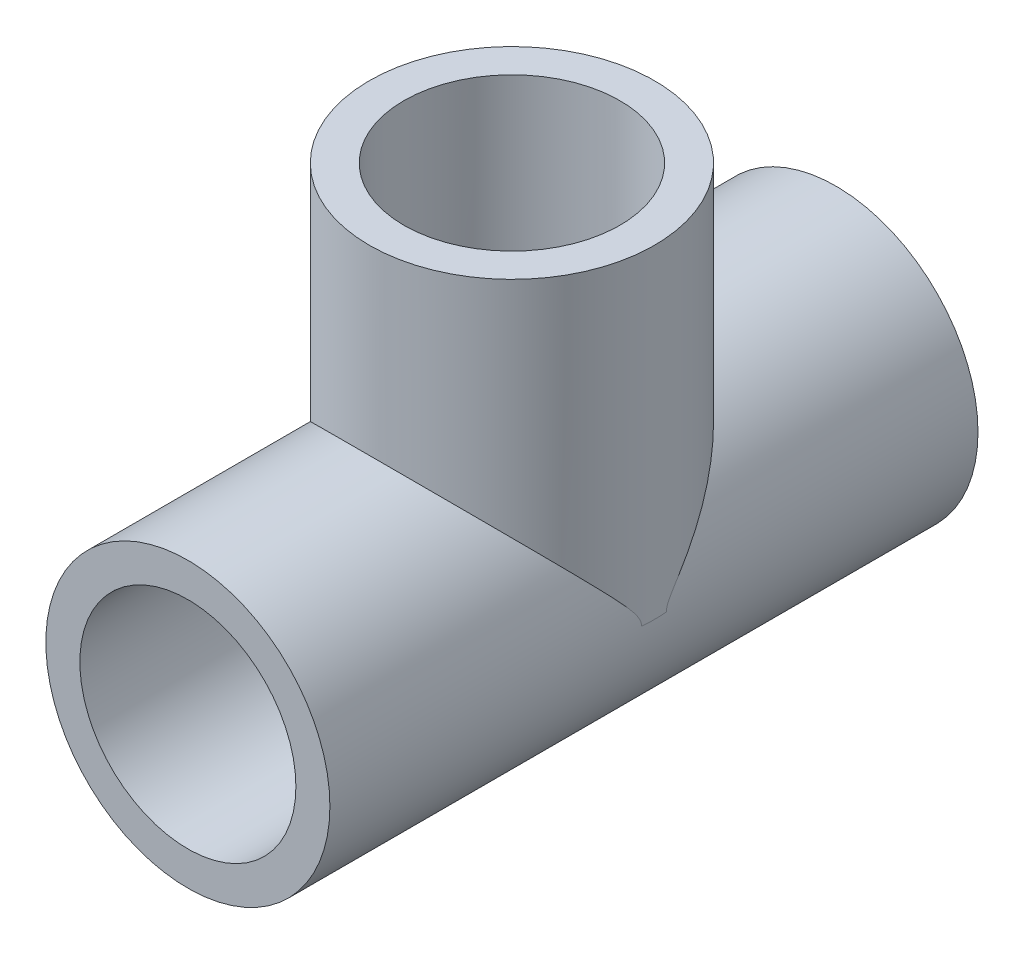
ISO-10303-21;
HEADER;
FILE_DESCRIPTION(('STEP AP214'),'2;1');
FILE_NAME('part.step','',(''),(''),'','','');
FILE_SCHEMA(('AUTOMOTIVE_DESIGN { 1 0 10303 214 1 1 1 1 }'));
ENDSEC;
DATA;
#1=APPLICATION_CONTEXT('core data for automotive mechanical design processes');
#2=APPLICATION_PROTOCOL_DEFINITION('international standard','automotive_design',2000,#1);
#3=PRODUCT_CONTEXT('',#1,'mechanical');
#4=PRODUCT('Part','Part','',(#3));
#5=PRODUCT_RELATED_PRODUCT_CATEGORY('part','',(#4));
#6=PRODUCT_DEFINITION_FORMATION('','',#4);
#7=PRODUCT_DEFINITION_CONTEXT('part definition',#1,'design');
#8=PRODUCT_DEFINITION('design','',#6,#7);
#9=PRODUCT_DEFINITION_SHAPE('','',#8);
#10=(LENGTH_UNIT() NAMED_UNIT(*) SI_UNIT(.MILLI.,.METRE.));
#11=(NAMED_UNIT(*) PLANE_ANGLE_UNIT() SI_UNIT($,.RADIAN.));
#12=(NAMED_UNIT(*) SI_UNIT($,.STERADIAN.) SOLID_ANGLE_UNIT());
#13=UNCERTAINTY_MEASURE_WITH_UNIT(LENGTH_MEASURE(1.E-05),#10,'distance_accuracy_value','');
#14=(GEOMETRIC_REPRESENTATION_CONTEXT(3) GLOBAL_UNCERTAINTY_ASSIGNED_CONTEXT((#13)) GLOBAL_UNIT_ASSIGNED_CONTEXT((#10,
#11,#12)) REPRESENTATION_CONTEXT('',''));
#15=CARTESIAN_POINT('',(0.,0.,0.));
#16=DIRECTION('',(0.,0.,1.));
#17=DIRECTION('',(1.,0.,0.));
#18=AXIS2_PLACEMENT_3D('',#15,#16,#17);
#19=CARTESIAN_POINT('',(0.,0.,76.2));
#20=DIRECTION('',(0.,0.,-1.));
#21=DIRECTION('',(-1.,0.,0.));
#22=AXIS2_PLACEMENT_3D('',#19,#20,#21);
#23=CYLINDRICAL_SURFACE('',#22,16.7005);
#24=CARTESIAN_POINT('',(0.,0.,0.));
#25=DIRECTION('',(0.,0.,1.));
#26=DIRECTION('',(1.,0.,0.));
#27=AXIS2_PLACEMENT_3D('',#24,#25,#26);
#28=CIRCLE('',#27,16.7005);
#29=CARTESIAN_POINT('',(16.7005,0.,0.));
#30=VERTEX_POINT('',#29);
#31=EDGE_CURVE('E36',#30,#30,#28,.T.);
#32=ORIENTED_EDGE('',*,*,#31,.T.);
#33=EDGE_LOOP('',(#32));
#34=FACE_BOUND('',#33,.T.);
#35=CARTESIAN_POINT('',(0.,0.,76.2));
#36=DIRECTION('',(0.,0.,1.));
#37=DIRECTION('',(1.,0.,0.));
#38=AXIS2_PLACEMENT_3D('',#35,#36,#37);
#39=CIRCLE('',#38,16.7005);
#40=CARTESIAN_POINT('',(16.7005,0.,76.2));
#41=VERTEX_POINT('',#40);
#42=EDGE_CURVE('E11',#41,#41,#39,.T.);
#43=ORIENTED_EDGE('',*,*,#42,.F.);
#44=EDGE_LOOP('',(#43));
#45=FACE_BOUND('',#44,.T.);
#46=CARTESIAN_POINT('',(-16.7005,0.,39.5577365159727));
#47=CARTESIAN_POINT('',(-16.7005251286461,0.111996368959197,39.5571767106316));
#48=CARTESIAN_POINT('',(-16.6993752591985,0.22260103806281,39.5707152625873));
#49=CARTESIAN_POINT('',(-16.6951208796233,0.436526074423678,39.6183321889609));
#50=CARTESIAN_POINT('',(-16.6920667096308,0.539960064143118,39.6518806402588));
#51=CARTESIAN_POINT('',(-16.6838494319844,0.754353341461653,39.7379488002845));
#52=CARTESIAN_POINT('',(-16.6784586674522,0.864465323782809,39.7924074873323));
#53=CARTESIAN_POINT('',(-16.6659487068092,1.07906179702426,39.9114876414859));
#54=CARTESIAN_POINT('',(-16.6588258034249,1.18353362235931,39.9761308003646));
#55=CARTESIAN_POINT('',(-16.6428386693208,1.3905584899851,40.1130760167246));
#56=CARTESIAN_POINT('',(-16.6339385401781,1.49301395150316,40.1855187566396));
#57=CARTESIAN_POINT('',(-16.6146035274624,1.69465784142516,40.3343463233907));
#58=CARTESIAN_POINT('',(-16.604170352097,1.79384975761032,40.4107267019747));
#59=CARTESIAN_POINT('',(-16.5677298945808,2.11351183817712,40.6638379682834));
#60=CARTESIAN_POINT('',(-16.5386528433956,2.32943684782911,40.8458358721227));
#61=CARTESIAN_POINT('',(-16.473044629303,2.7553080591183,41.2154450653867));
#62=CARTESIAN_POINT('',(-16.4365098361102,2.96525129200645,41.4030590505118));
#63=CARTESIAN_POINT('',(-16.3559461294241,3.38153000799109,41.7813246566225));
#64=CARTESIAN_POINT('',(-16.3119058123016,3.58785946644428,41.9719804937288));
#65=CARTESIAN_POINT('',(-16.2163562105779,3.99758520473609,42.3544549995031));
#66=CARTESIAN_POINT('',(-16.1648484830431,4.20098208636367,42.5462734177854));
#67=CARTESIAN_POINT('',(-15.9999822063845,4.80418676004487,43.1188654099404));
#68=CARTESIAN_POINT('',(-15.8755803307781,5.20060540189414,43.5001030172986));
#69=CARTESIAN_POINT('',(-15.5966881704435,5.98523907536274,44.2594427860084));
#70=CARTESIAN_POINT('',(-15.4422157787035,6.37345883406594,44.6375466732225));
#71=CARTESIAN_POINT('',(-15.0506027660059,7.25853366041298,45.5027018134886));
#72=CARTESIAN_POINT('',(-14.802611364034,7.75248383060804,45.9878805548028));
#73=CARTESIAN_POINT('',(-14.251839934001,8.72373117016352,46.944293360906));
#74=CARTESIAN_POINT('',(-13.9490326534834,9.20101991464142,47.4155203531891));
#75=CARTESIAN_POINT('',(-13.286097243611,10.134814712474,48.3388777128843));
#76=CARTESIAN_POINT('',(-12.9259288275267,10.5913058669891,48.7909943739216));
#77=CARTESIAN_POINT('',(-12.1460457357393,11.4772893075871,49.6693487474575));
#78=CARTESIAN_POINT('',(-11.7263723645169,11.9068000257924,50.0956041205616));
#79=CARTESIAN_POINT('',(-10.9944812725889,12.5767082769602,50.7608720726801));
#80=CARTESIAN_POINT('',(-10.7010462177984,12.8275835323413,51.0101189312445));
#81=CARTESIAN_POINT('',(-10.0896834082165,13.3138082176226,51.4933474872179));
#82=CARTESIAN_POINT('',(-9.7717579365446,13.5491590909954,51.7273306038426));
#83=CARTESIAN_POINT('',(-9.11182384444521,14.0014695857132,52.1771297496259));
#84=CARTESIAN_POINT('',(-8.76985275042945,14.2184567488692,52.3929729813967));
#85=CARTESIAN_POINT('',(-8.06171639560234,14.6315879843542,52.8040107256949));
#86=CARTESIAN_POINT('',(-7.69555505094563,14.8277354170779,52.9992085672571));
#87=CARTESIAN_POINT('',(-7.00637668068283,15.1636875036903,53.3335878813));
#88=CARTESIAN_POINT('',(-6.68708217662354,15.3073365049857,53.4765856652872));
#89=CARTESIAN_POINT('',(-6.03364019287753,15.5764784054269,53.7445362747823));
#90=CARTESIAN_POINT('',(-5.69949589953449,15.7019751751725,53.8694929471857));
#91=CARTESIAN_POINT('',(-5.01774826430361,15.9329340004158,54.0994771590938));
#92=CARTESIAN_POINT('',(-4.67014810721199,16.0384007622266,54.2045093801031));
#93=CARTESIAN_POINT('',(-3.96328287098092,16.2275359287304,54.3928771432704));
#94=CARTESIAN_POINT('',(-3.60401770187227,16.3112041652522,54.4762125180417));
#95=CARTESIAN_POINT('',(-2.87368484855777,16.455641533207,54.6200814985185));
#96=CARTESIAN_POINT('',(-2.50255226117265,16.5162466632778,54.6804517988625));
#97=CARTESIAN_POINT('',(-1.75385256023578,16.6124390787856,54.7762738667287));
#98=CARTESIAN_POINT('',(-1.37628542088767,16.6480262639005,54.811725534327));
#99=CARTESIAN_POINT('',(-0.618209793942862,16.6933712762367,54.85689817386));
#100=CARTESIAN_POINT('',(-0.237702499376272,16.7031390795703,54.8666290838004));
#101=CARTESIAN_POINT('',(0.522847649020037,16.6966437527952,54.8601583592158));
#102=CARTESIAN_POINT('',(0.902890541024494,16.6803829297541,54.8439590230385));
#103=CARTESIAN_POINT('',(1.61605537718988,16.6255256789242,54.789310800793));
#104=CARTESIAN_POINT('',(1.94960588083523,16.5896745856903,54.7535966870155));
#105=CARTESIAN_POINT('',(2.61131066906964,16.4984628842258,54.6627370093465));
#106=CARTESIAN_POINT('',(2.93946545144032,16.4431040863661,54.6075932485821));
#107=CARTESIAN_POINT('',(3.58839643775056,16.3137855731266,54.4787839185819));
#108=CARTESIAN_POINT('',(3.90917195661053,16.2398241382521,54.4051166371645));
#109=CARTESIAN_POINT('',(4.54161434609957,16.0744298662629,54.2403914474428));
#110=CARTESIAN_POINT('',(4.85328066677209,15.9829959767722,54.1493324916282));
#111=CARTESIAN_POINT('',(5.47916388071833,15.7796799090658,53.9468673176789));
#112=CARTESIAN_POINT('',(5.79292388210426,15.6670925924199,53.834759584271));
#113=CARTESIAN_POINT('',(6.40782093534273,15.4258105672968,53.5945313122499));
#114=CARTESIAN_POINT('',(6.70895803442978,15.2971159190998,53.4664108335632));
#115=CARTESIAN_POINT('',(7.29780052987731,15.025112157374,53.195655716848));
#116=CARTESIAN_POINT('',(7.58550518159943,14.881802235035,53.0530202755614));
#117=CARTESIAN_POINT('',(8.14696676338949,14.5820082367703,52.7546832915609));
#118=CARTESIAN_POINT('',(8.42072064731588,14.4255213032688,52.598978914732));
#119=CARTESIAN_POINT('',(9.09870568944363,14.0125724939912,52.1881699427184));
#120=CARTESIAN_POINT('',(9.49311774551568,13.7479441961759,51.9249803433335));
#121=CARTESIAN_POINT('',(10.2477189650742,13.1950728418727,51.3753176275857));
#122=CARTESIAN_POINT('',(10.6078934578822,12.9068197598841,51.0888346267623));
#123=CARTESIAN_POINT('',(11.2955608131879,12.3095537776275,50.4955203450277));
#124=CARTESIAN_POINT('',(11.6229343542789,12.0004714704564,50.1886210818487));
#125=CARTESIAN_POINT('',(12.2443173223242,11.365766960329,49.5588008876329));
#126=CARTESIAN_POINT('',(12.5383276366063,11.0401451975893,49.2358803830253));
#127=CARTESIAN_POINT('',(13.2012641914637,10.2466632526687,48.4496464989533));
#128=CARTESIAN_POINT('',(13.555333507378,9.7723924976596,47.9802325004095));
#129=CARTESIAN_POINT('',(14.2041570733257,8.80279212996302,47.0223595257029));
#130=CARTESIAN_POINT('',(14.4988806348625,8.30745178143919,46.5338908511569));
#131=CARTESIAN_POINT('',(15.0295931100441,7.30331543290625,45.5467904843643));
#132=CARTESIAN_POINT('',(15.2659622101086,6.79463178286962,45.0482487794971));
#133=CARTESIAN_POINT('',(15.5797821642993,6.02116047311737,44.2948433625744));
#134=CARTESIAN_POINT('',(15.6775842385594,5.76164914669673,44.0428274946686));
#135=CARTESIAN_POINT('',(15.8598680129746,5.23907385175182,43.5376773054745));
#136=CARTESIAN_POINT('',(15.944351055848,4.97601024424665,43.2845430995764));
#137=CARTESIAN_POINT('',(16.06843663226,4.553989911646,42.8813902658054));
#138=CARTESIAN_POINT('',(16.1123033454243,4.39627315861913,42.7313680043177));
#139=CARTESIAN_POINT('',(16.1954619153973,4.07928610760716,42.4316163128465));
#140=CARTESIAN_POINT('',(16.2347527211822,3.92001546178254,42.2818869578738));
#141=CARTESIAN_POINT('',(16.3093796856152,3.59704875214739,41.9807575245875));
#142=CARTESIAN_POINT('',(16.344640142386,3.43332299169103,41.8293704897799));
#143=CARTESIAN_POINT('',(16.410424039654,3.10369249279283,41.5283214893464));
#144=CARTESIAN_POINT('',(16.4409526880509,2.93779037106299,41.3786577974286));
#145=CARTESIAN_POINT('',(16.4978826068769,2.59935176894898,41.0791310077611));
#146=CARTESIAN_POINT('',(16.5241889427921,2.42674896247559,40.9293239773842));
#147=CARTESIAN_POINT('',(16.57197686003,2.07554057811239,40.634498691958));
#148=CARTESIAN_POINT('',(16.5934365728262,1.89691181418521,40.4895045652616));
#149=CARTESIAN_POINT('',(16.6305557000136,1.53720649394058,40.2152896293144));
#150=CARTESIAN_POINT('',(16.646398357308,1.35645770567681,40.0856861133314));
#151=CARTESIAN_POINT('',(16.6661632591712,1.0744382141964,39.9094916876245));
#152=CARTESIAN_POINT('',(16.6720707613242,0.97898154199546,39.8539642785911));
#153=CARTESIAN_POINT('',(16.6824201355762,0.783045150620935,39.7526060231748));
#154=CARTESIAN_POINT('',(16.6868659014163,0.682579610793822,39.706749534536));
#155=CARTESIAN_POINT('',(16.692041618074,0.533424079321074,39.6516903235852));
#156=CARTESIAN_POINT('',(16.6934622593586,0.487051017760795,39.6362951636614));
#157=CARTESIAN_POINT('',(16.6959359450739,0.39322652095813,39.6091722137916));
#158=CARTESIAN_POINT('',(16.6969890559523,0.34577528229875,39.5974437609634));
#159=CARTESIAN_POINT('',(16.6987157678893,0.24895237768714,39.5780702579519));
#160=CARTESIAN_POINT('',(16.6993806690974,0.19956137276843,39.5705190011622));
#161=CARTESIAN_POINT('',(16.70027483142,0.100127835830802,39.5603164316248));
#162=CARTESIAN_POINT('',(16.700502772658,0.0500837881294069,39.5576799650968));
#163=CARTESIAN_POINT('',(16.7005,-4.00495364785359E-13,39.5577365159737));
#164=B_SPLINE_CURVE_WITH_KNOTS('',3,(#46,#47,#48,#49,#50,#51,#52,#53,#54,#55,#56,#57,#58,#59,
#60,#61,#62,#63,#64,#65,#66,#67,#68,#69,#70,#71,#72,#73,#74,#75,#76,#77,#78,#79,#80,#81,#82,#83,
#84,#85,#86,#87,#88,#89,#90,#91,#92,#93,#94,#95,#96,#97,#98,#99,#100,#101,#102,#103,#104,#105,
#106,#107,#108,#109,#110,#111,#112,#113,#114,#115,#116,#117,#118,#119,#120,#121,#122,#123,#124,
#125,#126,#127,#128,#129,#130,#131,#132,#133,#134,#135,#136,#137,#138,#139,#140,#141,#142,#143,
#144,#145,#146,#147,#148,#149,#150,#151,#152,#153,#154,#155,#156,#157,#158,#159,#160,#161,#162,
#163),.UNSPECIFIED.,.F.,.F.,(4,2,2,2,2,2,2,2,2,2,2,2,2,2,2,2,2,2,2,2,2,2,2,2,2,2,2,2,2,2,2,2,2,
2,2,2,2,2,2,2,2,2,2,2,2,2,2,2,2,2,2,2,2,2,2,2,2,2,4),(0.,0.333026551942057,0.657602433094089,
1.02564631106668,1.39448495066165,1.77170680368825,2.14851147790377,2.99973449028911,
3.85137285404972,4.70431689512341,5.55708333977153,7.24778757330032,8.93748883810513,
11.1415522493757,13.3467144651722,15.553432329385,17.7586258645436,19.1362130342943,
20.5136719335158,21.8890268961933,23.2641597459866,24.3976914293521,25.5309810523399,
26.6640040637311,27.7970358159103,28.9379803317917,30.0789294228397,31.2194376086363,
32.3598447101973,33.3707819802232,34.3816254570701,35.392562403418,36.4035602582793,
37.4576243771105,38.5116845513142,39.5658030889669,40.620150815146,42.2467071243122,
43.8739572948376,45.506927038956,47.1398533424583,49.4027466184582,51.666807079096,
53.9157026978231,55.0396970103388,56.1635779381816,56.8296795422215,57.495933840271,
58.1731500202067,58.8496154705107,59.5396324217912,60.2327032292161,60.9004570245115,
61.2319367827754,61.5625262606,61.7090512083929,61.8555496514739,62.0052162864706,
62.1553342948625),.UNSPECIFIED.);
#165=CARTESIAN_POINT('',(-16.7005,0.,39.5577365159728));
#166=VERTEX_POINT('',#165);
#167=CARTESIAN_POINT('',(16.7005,0.,39.5577365159726));
#168=VERTEX_POINT('',#167);
#169=EDGE_CURVE('E90',#166,#168,#164,.T.);
#170=ORIENTED_EDGE('',*,*,#169,.F.);
#171=DIRECTION('',(0.,0.,-1.));
#172=VECTOR('',#171,1.);
#173=CARTESIAN_POINT('',(-16.7005,0.,76.2));
#174=LINE('',#173,#172);
#175=CARTESIAN_POINT('',(-16.7005,0.,36.6422634840273));
#176=VERTEX_POINT('',#175);
#177=EDGE_CURVE('E129',#176,#166,#174,.F.);
#178=ORIENTED_EDGE('',*,*,#177,.F.);
#179=CARTESIAN_POINT('',(16.7005,0.,36.6422634840274));
#180=CARTESIAN_POINT('',(16.7005251286461,0.111996368959192,36.6428232893686));
#181=CARTESIAN_POINT('',(16.6993752591985,0.222601038062792,36.6292847374129));
#182=CARTESIAN_POINT('',(16.6951208796233,0.436526074423631,36.5816678110393));
#183=CARTESIAN_POINT('',(16.6920667096308,0.539960064143053,36.5481193597414));
#184=CARTESIAN_POINT('',(16.6838494319844,0.754353341461563,36.4620511997157));
#185=CARTESIAN_POINT('',(16.6784586674522,0.864465323782711,36.4075925126679));
#186=CARTESIAN_POINT('',(16.6659487068092,1.07906179702415,36.2885123585143));
#187=CARTESIAN_POINT('',(16.6588258034249,1.18353362235919,36.2238691996356));
#188=CARTESIAN_POINT('',(16.6428386693208,1.39055848998496,36.0869239832756));
#189=CARTESIAN_POINT('',(16.6339385401781,1.49301395150301,36.0144812433606));
#190=CARTESIAN_POINT('',(16.6146035274624,1.69465784142499,35.8656536766095));
#191=CARTESIAN_POINT('',(16.604170352097,1.79384975761015,35.7892732980255));
#192=CARTESIAN_POINT('',(16.5677298945808,2.11351183817693,35.5361620317169));
#193=CARTESIAN_POINT('',(16.5386528433956,2.32943684782888,35.3541641278776));
#194=CARTESIAN_POINT('',(16.4730446293031,2.75530805911801,34.9845549346136));
#195=CARTESIAN_POINT('',(16.4365098361102,2.96525129200616,34.7969409494886));
#196=CARTESIAN_POINT('',(16.3559461294242,3.38153000799076,34.418675343378));
#197=CARTESIAN_POINT('',(16.3119058123017,3.5878594664439,34.2280195062716));
#198=CARTESIAN_POINT('',(16.216356210578,3.99758520473566,33.8455450004974));
#199=CARTESIAN_POINT('',(16.1648484830432,4.20098208636323,33.6537265822151));
#200=CARTESIAN_POINT('',(15.9999822063847,4.80418676004438,33.0811345900601));
#201=CARTESIAN_POINT('',(15.8755803307783,5.20060540189359,32.6998969827019));
#202=CARTESIAN_POINT('',(15.5966881704438,5.98523907536209,31.9405572139922));
#203=CARTESIAN_POINT('',(15.4422157787038,6.37345883406526,31.5624533267782));
#204=CARTESIAN_POINT('',(15.0506027660063,7.2585336604123,30.6972981865121));
#205=CARTESIAN_POINT('',(14.8026113640343,7.75248383060738,30.2121194451979));
#206=CARTESIAN_POINT('',(14.2518399340014,8.72373117016293,29.2557066390946));
#207=CARTESIAN_POINT('',(13.9490326534838,9.20101991464087,28.7844796468115));
#208=CARTESIAN_POINT('',(13.2860972436114,10.1348147124736,27.8611222871162));
#209=CARTESIAN_POINT('',(12.9259288275271,10.5913058669887,27.4090056260788));
#210=CARTESIAN_POINT('',(12.1460457357397,11.4772893075867,26.5306512525429));
#211=CARTESIAN_POINT('',(11.7263723645173,11.906800025792,26.1043958794388));
#212=CARTESIAN_POINT('',(10.9944812725892,12.5767082769599,25.4391279273202));
#213=CARTESIAN_POINT('',(10.7010462177988,12.827583532341,25.1898810687558));
#214=CARTESIAN_POINT('',(10.0896834082168,13.3138082176223,24.7066525127824));
#215=CARTESIAN_POINT('',(9.77175793654496,13.5491590909951,24.4726693961577));
#216=CARTESIAN_POINT('',(9.11182384444558,14.0014695857129,24.0228702503743));
#217=CARTESIAN_POINT('',(8.76985275042982,14.218456748869,23.8070270186036));
#218=CARTESIAN_POINT('',(8.06171639560271,14.631587984354,23.3959892743053));
#219=CARTESIAN_POINT('',(7.695555050946,14.8277354170777,23.2007914327431));
#220=CARTESIAN_POINT('',(7.0063766806832,15.1636875036901,22.8664121187001));
#221=CARTESIAN_POINT('',(6.68708217662391,15.3073365049856,22.723414334713));
#222=CARTESIAN_POINT('',(6.03364019287791,15.5764784054268,22.4554637252178));
#223=CARTESIAN_POINT('',(5.69949589953486,15.7019751751724,22.3305070528144));
#224=CARTESIAN_POINT('',(5.01774826430399,15.9329340004157,22.1005228409063));
#225=CARTESIAN_POINT('',(4.67014810721237,16.0384007622265,21.9954906198971));
#226=CARTESIAN_POINT('',(3.96328287098129,16.2275359287303,21.8071228567297));
#227=CARTESIAN_POINT('',(3.60401770187264,16.3112041652521,21.7237874819584));
#228=CARTESIAN_POINT('',(2.87368484855813,16.4556415332069,21.5799185014816));
#229=CARTESIAN_POINT('',(2.502552261173,16.5162466632778,21.5195482011375));
#230=CARTESIAN_POINT('',(1.75385256023613,16.6124390787856,21.4237261332713));
#231=CARTESIAN_POINT('',(1.37628542088801,16.6480262639004,21.388274465673));
#232=CARTESIAN_POINT('',(0.618209793943192,16.6933712762367,21.34310182614));
#233=CARTESIAN_POINT('',(0.237702499376596,16.7031390795703,21.3333709161996));
#234=CARTESIAN_POINT('',(-0.522847649019726,16.6966437527952,21.3398416407842));
#235=CARTESIAN_POINT('',(-0.90289054102419,16.6803829297541,21.3560409769615));
#236=CARTESIAN_POINT('',(-1.61605537718959,16.6255256789242,21.410689199207));
#237=CARTESIAN_POINT('',(-1.94960588083494,16.5896745856903,21.4464033129845));
#238=CARTESIAN_POINT('',(-2.61131066906935,16.4984628842259,21.5372629906534));
#239=CARTESIAN_POINT('',(-2.93946545144004,16.4431040863662,21.5924067514178));
#240=CARTESIAN_POINT('',(-3.58839643775028,16.3137855731267,21.721216081418));
#241=CARTESIAN_POINT('',(-3.90917195661026,16.2398241382522,21.7948833628354));
#242=CARTESIAN_POINT('',(-4.5416143460993,16.074429866263,21.9596085525571));
#243=CARTESIAN_POINT('',(-4.85328066677184,15.9829959767723,22.0506675083717));
#244=CARTESIAN_POINT('',(-5.47916388071808,15.7796799090658,22.253132682321));
#245=CARTESIAN_POINT('',(-5.79292388210401,15.66709259242,22.3652404157289));
#246=CARTESIAN_POINT('',(-6.40782093534248,15.4258105672969,22.60546868775));
#247=CARTESIAN_POINT('',(-6.70895803442954,15.2971159190999,22.7335891664367));
#248=CARTESIAN_POINT('',(-7.29780052987707,15.0251121573741,23.0043442831519));
#249=CARTESIAN_POINT('',(-7.58550518159919,14.8818022350351,23.1469797244384));
#250=CARTESIAN_POINT('',(-8.14696676338925,14.5820082367704,23.445316708439));
#251=CARTESIAN_POINT('',(-8.42072064731565,14.425521303269,23.6010210852678));
#252=CARTESIAN_POINT('',(-9.0987056894434,14.0125724939913,24.0118300572815));
#253=CARTESIAN_POINT('',(-9.49311774551545,13.7479441961761,24.2750196566663));
#254=CARTESIAN_POINT('',(-10.247718965074,13.1950728418729,24.8246823724141));
#255=CARTESIAN_POINT('',(-10.607893457882,12.9068197598843,25.1111653732375));
#256=CARTESIAN_POINT('',(-11.2955608131877,12.3095537776278,25.704479654972));
#257=CARTESIAN_POINT('',(-11.6229343542787,12.0004714704566,26.0113789181511));
#258=CARTESIAN_POINT('',(-12.244317322324,11.3657669603292,26.6411991123669));
#259=CARTESIAN_POINT('',(-12.5383276366061,11.0401451975896,26.9641196169745));
#260=CARTESIAN_POINT('',(-13.2012641914634,10.246663252669,27.7503535010464));
#261=CARTESIAN_POINT('',(-13.5553335073778,9.77239249765988,28.2197674995902));
#262=CARTESIAN_POINT('',(-14.2041570733256,8.80279212996332,29.1776404742968));
#263=CARTESIAN_POINT('',(-14.4988806348623,8.3074517814395,29.6661091488428));
#264=CARTESIAN_POINT('',(-15.0295931100439,7.30331543290658,30.6532095156354));
#265=CARTESIAN_POINT('',(-15.2659622101085,6.79463178286996,31.1517512205025));
#266=CARTESIAN_POINT('',(-15.5797821642991,6.02116047311773,31.9051566374252));
#267=CARTESIAN_POINT('',(-15.6775842385592,5.7616491466971,32.157172505331));
#268=CARTESIAN_POINT('',(-15.8598680129745,5.2390738517522,32.6623226945251));
#269=CARTESIAN_POINT('',(-15.9443510558479,4.97601024424702,32.9154569004232));
#270=CARTESIAN_POINT('',(-16.0684366322599,4.55398991164637,33.3186097341942));
#271=CARTESIAN_POINT('',(-16.1123033454242,4.3962731586195,33.4686319956819));
#272=CARTESIAN_POINT('',(-16.1954619153972,4.07928610760751,33.7683836871531));
#273=CARTESIAN_POINT('',(-16.2347527211821,3.92001546178286,33.9181130421259));
#274=CARTESIAN_POINT('',(-16.3093796856151,3.59704875214769,34.2192424754121));
#275=CARTESIAN_POINT('',(-16.3446401423859,3.43332299169134,34.3706295102197));
#276=CARTESIAN_POINT('',(-16.4104240396539,3.10369249279311,34.6716785106533));
#277=CARTESIAN_POINT('',(-16.4409526880508,2.93779037106325,34.821342202571));
#278=CARTESIAN_POINT('',(-16.4978826068769,2.59935176894922,35.1208689922385));
#279=CARTESIAN_POINT('',(-16.5241889427921,2.42674896247582,35.2706760226155));
#280=CARTESIAN_POINT('',(-16.57197686003,2.0755405781126,35.5655013080417));
#281=CARTESIAN_POINT('',(-16.5934365728262,1.8969118141854,35.710495434738));
#282=CARTESIAN_POINT('',(-16.6305557000136,1.53720649394075,35.9847103706853));
#283=CARTESIAN_POINT('',(-16.646398357308,1.35645770567696,36.1143138866683));
#284=CARTESIAN_POINT('',(-16.6661632591712,1.07443821419655,36.2905083123753));
#285=CARTESIAN_POINT('',(-16.6720707613242,0.978981541995612,36.3460357214087));
#286=CARTESIAN_POINT('',(-16.6824201355762,0.783045150621075,36.447393976825));
#287=CARTESIAN_POINT('',(-16.6868659014163,0.682579610793948,36.4932504654638));
#288=CARTESIAN_POINT('',(-16.692041618074,0.53342407932119,36.5483096764146));
#289=CARTESIAN_POINT('',(-16.6934622593586,0.487051017760906,36.5637048363384));
#290=CARTESIAN_POINT('',(-16.6959359450739,0.393226520958214,36.5908277862082));
#291=CARTESIAN_POINT('',(-16.6969890559523,0.345775282298814,36.6025562390364));
#292=CARTESIAN_POINT('',(-16.6987157678893,0.248952377687175,36.6219297420478));
#293=CARTESIAN_POINT('',(-16.6993806690974,0.199561372768455,36.6294809988375));
#294=CARTESIAN_POINT('',(-16.70027483142,0.100127835830815,36.639683568375));
#295=CARTESIAN_POINT('',(-16.700502772658,0.0500837881294158,36.6423200349031));
#296=CARTESIAN_POINT('',(-16.7005,-4.0476718840862E-13,36.6422634840262));
#297=B_SPLINE_CURVE_WITH_KNOTS('',3,(#179,#180,#181,#182,#183,#184,#185,#186,#187,#188,#189,
#190,#191,#192,#193,#194,#195,#196,#197,#198,#199,#200,#201,#202,#203,#204,#205,#206,#207,#208,
#209,#210,#211,#212,#213,#214,#215,#216,#217,#218,#219,#220,#221,#222,#223,#224,#225,#226,#227,
#228,#229,#230,#231,#232,#233,#234,#235,#236,#237,#238,#239,#240,#241,#242,#243,#244,#245,#246,
#247,#248,#249,#250,#251,#252,#253,#254,#255,#256,#257,#258,#259,#260,#261,#262,#263,#264,#265,
#266,#267,#268,#269,#270,#271,#272,#273,#274,#275,#276,#277,#278,#279,#280,#281,#282,#283,#284,
#285,#286,#287,#288,#289,#290,#291,#292,#293,#294,#295,#296),.UNSPECIFIED.,.F.,.F.,(4,2,2,2,2,2,
2,2,2,2,2,2,2,2,2,2,2,2,2,2,2,2,2,2,2,2,2,2,2,2,2,2,2,2,2,2,2,2,2,2,2,2,2,2,2,2,2,2,2,2,2,2,2,2,
2,2,2,2,4),(0.,0.333026551942017,0.657602433094007,1.02564631106656,1.39448495066151,
1.77170680368808,2.14851147790356,2.99973449028881,3.85137285404933,4.70431689512293,
5.55708333977095,7.24778757329955,8.93748883810416,11.1415522493748,13.3467144651715,
15.5534323293844,17.7586258645431,19.1362130342938,20.5136719335154,21.8890268961929,
23.2641597459863,24.3976914293518,25.5309810523396,26.6640040637308,27.7970358159101,
28.9379803317914,30.0789294228394,31.219437608636,32.3598447101971,33.370781980223,
34.38162545707,35.3925624034178,36.4035602582791,37.4576243771104,38.511684551314,
39.5658030889667,40.6201508151458,42.246707124312,43.8739572948373,45.5069270389557,
47.139853342458,49.4027466184578,51.6668070790956,53.9157026978227,55.0396970103384,
56.1635779381811,56.8296795422211,57.4959338402706,58.1731500202063,58.8496154705104,
59.5396324217909,60.2327032292159,60.9004570245113,61.2319367827753,61.5625262605999,
61.7090512083928,61.8555496514739,62.0052162864706,62.1553342948625),.UNSPECIFIED.);
#298=CARTESIAN_POINT('',(16.7005,0.,36.6422634840274));
#299=VERTEX_POINT('',#298);
#300=EDGE_CURVE('E79',#299,#176,#297,.T.);
#301=ORIENTED_EDGE('',*,*,#300,.F.);
#302=DIRECTION('',(0.,0.,-1.));
#303=VECTOR('',#302,1.);
#304=CARTESIAN_POINT('',(16.7005,0.,76.2));
#305=LINE('',#304,#303);
#306=EDGE_CURVE('E54',#168,#299,#305,.T.);
#307=ORIENTED_EDGE('',*,*,#306,.F.);
#308=EDGE_LOOP('',(#170,#178,#301,#307));
#309=FACE_BOUND('',#308,.T.);
#310=ADVANCED_FACE('F32',(#34,#45,#309),#23,.T.);
#311=CARTESIAN_POINT('',(0.,0.,76.2));
#312=DIRECTION('',(0.,0.,1.));
#313=DIRECTION('',(1.,0.,0.));
#314=AXIS2_PLACEMENT_3D('',#311,#312,#313);
#315=PLANE('',#314);
#316=ORIENTED_EDGE('',*,*,#42,.T.);
#317=EDGE_LOOP('',(#316));
#318=FACE_BOUND('',#317,.T.);
#319=CARTESIAN_POINT('',(0.,0.,76.2));
#320=DIRECTION('',(0.,0.,1.));
#321=DIRECTION('',(1.,0.,0.));
#322=AXIS2_PLACEMENT_3D('',#319,#320,#321);
#323=CIRCLE('',#322,12.7);
#324=CARTESIAN_POINT('',(12.7,0.,76.2));
#325=VERTEX_POINT('',#324);
#326=EDGE_CURVE('E138',#325,#325,#323,.T.);
#327=ORIENTED_EDGE('',*,*,#326,.F.);
#328=EDGE_LOOP('',(#327));
#329=FACE_BOUND('',#328,.T.);
#330=ADVANCED_FACE('F109',(#318,#329),#315,.T.);
#331=CARTESIAN_POINT('',(0.,0.,0.));
#332=DIRECTION('',(0.,0.,1.));
#333=DIRECTION('',(1.,0.,0.));
#334=AXIS2_PLACEMENT_3D('',#331,#332,#333);
#335=PLANE('',#334);
#336=ORIENTED_EDGE('',*,*,#31,.F.);
#337=EDGE_LOOP('',(#336));
#338=FACE_BOUND('',#337,.T.);
#339=CARTESIAN_POINT('',(0.,0.,0.));
#340=DIRECTION('',(0.,0.,1.));
#341=DIRECTION('',(1.,0.,0.));
#342=AXIS2_PLACEMENT_3D('',#339,#340,#341);
#343=CIRCLE('',#342,12.7);
#344=CARTESIAN_POINT('',(12.7,0.,0.));
#345=VERTEX_POINT('',#344);
#346=EDGE_CURVE('E135',#345,#345,#343,.T.);
#347=ORIENTED_EDGE('',*,*,#346,.T.);
#348=EDGE_LOOP('',(#347));
#349=FACE_BOUND('',#348,.T.);
#350=ADVANCED_FACE('F111',(#338,#349),#335,.F.);
#351=CARTESIAN_POINT('',(0.,0.,38.1));
#352=DIRECTION('',(0.,1.,0.));
#353=DIRECTION('',(0.,0.,1.));
#354=AXIS2_PLACEMENT_3D('',#351,#352,#353);
#355=PLANE('',#354);
#356=CARTESIAN_POINT('',(0.,0.,38.1));
#357=DIRECTION('',(0.,1.,0.));
#358=DIRECTION('',(0.,0.,1.));
#359=AXIS2_PLACEMENT_3D('',#356,#357,#358);
#360=CIRCLE('',#359,16.764);
#361=EDGE_CURVE('E80',#168,#299,#360,.T.);
#362=ORIENTED_EDGE('',*,*,#361,.F.);
#363=ORIENTED_EDGE('',*,*,#306,.T.);
#364=EDGE_LOOP('',(#362,#363));
#365=FACE_BOUND('',#364,.T.);
#366=ADVANCED_FACE('F103',(#365),#355,.F.);
#367=EDGE_CURVE('E73',#176,#166,#360,.T.);
#368=ORIENTED_EDGE('',*,*,#367,.F.);
#369=ORIENTED_EDGE('',*,*,#177,.T.);
#370=EDGE_LOOP('',(#368,#369));
#371=FACE_BOUND('',#370,.T.);
#372=ADVANCED_FACE('F101',(#371),#355,.F.);
#373=CARTESIAN_POINT('',(0.,38.1,38.1));
#374=DIRECTION('',(0.,-1.,0.));
#375=DIRECTION('',(0.,0.,-1.));
#376=AXIS2_PLACEMENT_3D('',#373,#374,#375);
#377=CYLINDRICAL_SURFACE('',#376,16.764);
#378=CARTESIAN_POINT('',(0.,38.1,38.1));
#379=DIRECTION('',(0.,1.,0.));
#380=DIRECTION('',(0.,0.,1.));
#381=AXIS2_PLACEMENT_3D('',#378,#379,#380);
#382=CIRCLE('',#381,16.764);
#383=CARTESIAN_POINT('',(0.,38.1,54.864));
#384=VERTEX_POINT('',#383);
#385=EDGE_CURVE('E76',#384,#384,#382,.T.);
#386=ORIENTED_EDGE('',*,*,#385,.F.);
#387=EDGE_LOOP('',(#386));
#388=FACE_BOUND('',#387,.T.);
#389=ORIENTED_EDGE('',*,*,#367,.T.);
#390=ORIENTED_EDGE('',*,*,#169,.T.);
#391=ORIENTED_EDGE('',*,*,#361,.T.);
#392=ORIENTED_EDGE('',*,*,#300,.T.);
#393=EDGE_LOOP('',(#389,#390,#391,#392));
#394=FACE_BOUND('',#393,.T.);
#395=ADVANCED_FACE('F96',(#388,#394),#377,.T.);
#396=CARTESIAN_POINT('',(0.,38.1,38.1));
#397=DIRECTION('',(0.,-1.,0.));
#398=DIRECTION('',(0.,0.,-1.));
#399=AXIS2_PLACEMENT_3D('',#396,#397,#398);
#400=CYLINDRICAL_SURFACE('',#399,12.7);
#401=CARTESIAN_POINT('',(0.,38.1,38.1));
#402=DIRECTION('',(0.,1.,0.));
#403=DIRECTION('',(0.,0.,1.));
#404=AXIS2_PLACEMENT_3D('',#401,#402,#403);
#405=CIRCLE('',#404,12.7);
#406=CARTESIAN_POINT('',(0.,38.1,50.8));
#407=VERTEX_POINT('',#406);
#408=EDGE_CURVE('E70',#407,#407,#405,.T.);
#409=ORIENTED_EDGE('',*,*,#408,.T.);
#410=EDGE_LOOP('',(#409));
#411=FACE_BOUND('',#410,.T.);
#412=CARTESIAN_POINT('',(0.,0.,38.1));
#413=DIRECTION('',(0.,0.707106781186548,0.707106781186547));
#414=DIRECTION('',(0.,0.707106781186548,-0.707106781186547));
#415=AXIS2_PLACEMENT_3D('',#412,#413,#414);
#416=ELLIPSE('',#415,17.9605122421383,12.7);
#417=CARTESIAN_POINT('',(12.7,0.,38.1));
#418=VERTEX_POINT('',#417);
#419=CARTESIAN_POINT('',(-12.7,0.,38.1));
#420=VERTEX_POINT('',#419);
#421=EDGE_CURVE('E64',#418,#420,#416,.T.);
#422=ORIENTED_EDGE('',*,*,#421,.F.);
#423=CARTESIAN_POINT('',(0.,0.,38.1));
#424=DIRECTION('',(0.,0.707106781186548,-0.707106781186547));
#425=DIRECTION('',(0.,0.707106781186548,0.707106781186547));
#426=AXIS2_PLACEMENT_3D('',#423,#424,#425);
#427=ELLIPSE('',#426,17.9605122421383,12.7);
#428=EDGE_CURVE('E46',#420,#418,#427,.T.);
#429=ORIENTED_EDGE('',*,*,#428,.F.);
#430=EDGE_LOOP('',(#422,#429));
#431=FACE_BOUND('',#430,.T.);
#432=ADVANCED_FACE('F65',(#411,#431),#400,.F.);
#433=CARTESIAN_POINT('',(0.,38.1,38.1));
#434=DIRECTION('',(0.,1.,0.));
#435=DIRECTION('',(0.,0.,1.));
#436=AXIS2_PLACEMENT_3D('',#433,#434,#435);
#437=PLANE('',#436);
#438=ORIENTED_EDGE('',*,*,#385,.T.);
#439=EDGE_LOOP('',(#438));
#440=FACE_BOUND('',#439,.T.);
#441=ORIENTED_EDGE('',*,*,#408,.F.);
#442=EDGE_LOOP('',(#441));
#443=FACE_BOUND('',#442,.T.);
#444=ADVANCED_FACE('F108',(#440,#443),#437,.T.);
#445=CARTESIAN_POINT('',(0.,0.,76.2));
#446=DIRECTION('',(0.,0.,-1.));
#447=DIRECTION('',(-1.,0.,0.));
#448=AXIS2_PLACEMENT_3D('',#445,#446,#447);
#449=CYLINDRICAL_SURFACE('',#448,12.7);
#450=ORIENTED_EDGE('',*,*,#428,.T.);
#451=ORIENTED_EDGE('',*,*,#421,.T.);
#452=EDGE_LOOP('',(#450,#451));
#453=FACE_BOUND('',#452,.T.);
#454=ORIENTED_EDGE('',*,*,#326,.T.);
#455=EDGE_LOOP('',(#454));
#456=FACE_BOUND('',#455,.T.);
#457=ORIENTED_EDGE('',*,*,#346,.F.);
#458=EDGE_LOOP('',(#457));
#459=FACE_BOUND('',#458,.T.);
#460=ADVANCED_FACE('F68',(#453,#456,#459),#449,.F.);
#461=CLOSED_SHELL('',(#310,#330,#350,#366,#372,#395,#432,#444,#460));
#462=MANIFOLD_SOLID_BREP('B2',#461);
#463=ADVANCED_BREP_SHAPE_REPRESENTATION('',(#18,#462),#14);
#464=SHAPE_DEFINITION_REPRESENTATION(#9,#463);
ENDSEC;
END-ISO-10303-21;
